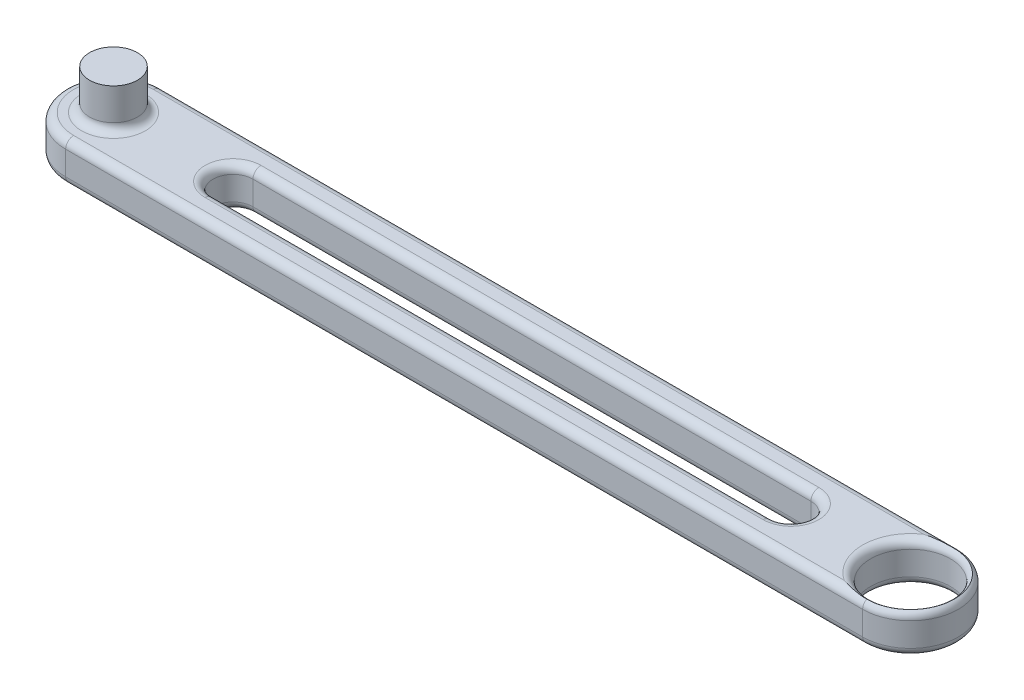
ISO-10303-21;
HEADER;
FILE_DESCRIPTION(('STEP AP214'),'2;1');
FILE_NAME('part.step','',(''),(''),'','','');
FILE_SCHEMA(('AUTOMOTIVE_DESIGN { 1 0 10303 214 1 1 1 1 }'));
ENDSEC;
DATA;
#1=APPLICATION_CONTEXT('core data for automotive mechanical design processes');
#2=APPLICATION_PROTOCOL_DEFINITION('international standard','automotive_design',2000,#1);
#3=PRODUCT_CONTEXT('',#1,'mechanical');
#4=PRODUCT('Part','Part','',(#3));
#5=PRODUCT_RELATED_PRODUCT_CATEGORY('part','',(#4));
#6=PRODUCT_DEFINITION_FORMATION('','',#4);
#7=PRODUCT_DEFINITION_CONTEXT('part definition',#1,'design');
#8=PRODUCT_DEFINITION('design','',#6,#7);
#9=PRODUCT_DEFINITION_SHAPE('','',#8);
#10=(LENGTH_UNIT() NAMED_UNIT(*) SI_UNIT(.MILLI.,.METRE.));
#11=(NAMED_UNIT(*) PLANE_ANGLE_UNIT() SI_UNIT($,.RADIAN.));
#12=(NAMED_UNIT(*) SI_UNIT($,.STERADIAN.) SOLID_ANGLE_UNIT());
#13=UNCERTAINTY_MEASURE_WITH_UNIT(LENGTH_MEASURE(1.E-05),#10,'distance_accuracy_value','');
#14=(GEOMETRIC_REPRESENTATION_CONTEXT(3) GLOBAL_UNCERTAINTY_ASSIGNED_CONTEXT((#13)) GLOBAL_UNIT_ASSIGNED_CONTEXT((#10,
#11,#12)) REPRESENTATION_CONTEXT('',''));
#15=CARTESIAN_POINT('',(0.,0.,0.));
#16=DIRECTION('',(0.,0.,1.));
#17=DIRECTION('',(1.,0.,0.));
#18=AXIS2_PLACEMENT_3D('',#15,#16,#17);
#19=CARTESIAN_POINT('',(-25.,0.,0.));
#20=DIRECTION('',(0.,1.,0.));
#21=DIRECTION('',(0.,0.,1.));
#22=AXIS2_PLACEMENT_3D('',#19,#20,#21);
#23=CYLINDRICAL_SURFACE('',#22,2.5);
#24=DIRECTION('',(0.,1.,0.));
#25=VECTOR('',#24,1.);
#26=CARTESIAN_POINT('',(-25.,0.,2.5));
#27=LINE('',#26,#25);
#28=CARTESIAN_POINT('',(-25.,1.,2.5));
#29=VERTEX_POINT('',#28);
#30=CARTESIAN_POINT('',(-25.,4.,2.5));
#31=VERTEX_POINT('',#30);
#32=EDGE_CURVE('E441',#29,#31,#27,.T.);
#33=ORIENTED_EDGE('',*,*,#32,.F.);
#34=CARTESIAN_POINT('',(-25.,1.,0.));
#35=DIRECTION('',(0.,1.,0.));
#36=DIRECTION('',(0.,0.,1.));
#37=AXIS2_PLACEMENT_3D('',#34,#35,#36);
#38=CIRCLE('',#37,2.5);
#39=CARTESIAN_POINT('',(-25.,1.,-2.5));
#40=VERTEX_POINT('',#39);
#41=EDGE_CURVE('E425',#29,#40,#38,.F.);
#42=ORIENTED_EDGE('',*,*,#41,.T.);
#43=DIRECTION('',(0.,1.,0.));
#44=VECTOR('',#43,1.);
#45=CARTESIAN_POINT('',(-25.,0.,-2.5));
#46=LINE('',#45,#44);
#47=CARTESIAN_POINT('',(-25.,4.,-2.5));
#48=VERTEX_POINT('',#47);
#49=EDGE_CURVE('E435',#40,#48,#46,.T.);
#50=ORIENTED_EDGE('',*,*,#49,.T.);
#51=CARTESIAN_POINT('',(-25.,4.,0.));
#52=DIRECTION('',(0.,1.,0.));
#53=DIRECTION('',(0.,0.,1.));
#54=AXIS2_PLACEMENT_3D('',#51,#52,#53);
#55=CIRCLE('',#54,2.5);
#56=EDGE_CURVE('E422',#48,#31,#55,.T.);
#57=ORIENTED_EDGE('',*,*,#56,.T.);
#58=EDGE_LOOP('',(#33,#42,#50,#57));
#59=FACE_BOUND('',#58,.T.);
#60=ADVANCED_FACE('F37',(#59),#23,.F.);
#61=CARTESIAN_POINT('',(-40.,5.,0.));
#62=DIRECTION('',(0.,-1.,0.));
#63=DIRECTION('',(0.,0.,-1.));
#64=AXIS2_PLACEMENT_3D('',#61,#62,#63);
#65=CYLINDRICAL_SURFACE('',#64,6.00000000000001);
#66=DIRECTION('',(0.,-1.,0.));
#67=VECTOR('',#66,1.);
#68=CARTESIAN_POINT('',(-40.,5.,-5.99999999999999));
#69=LINE('',#68,#67);
#70=CARTESIAN_POINT('',(-40.,4.,-5.99999999999999));
#71=VERTEX_POINT('',#70);
#72=CARTESIAN_POINT('',(-40.,1.,-5.99999999999999));
#73=VERTEX_POINT('',#72);
#74=EDGE_CURVE('E439',#71,#73,#69,.T.);
#75=ORIENTED_EDGE('',*,*,#74,.T.);
#76=CARTESIAN_POINT('',(-40.,1.,0.));
#77=DIRECTION('',(0.,1.,0.));
#78=DIRECTION('',(0.,0.,1.));
#79=AXIS2_PLACEMENT_3D('',#76,#77,#78);
#80=CIRCLE('',#79,6.00000000000001);
#81=CARTESIAN_POINT('',(-40.,1.,5.99999999999999));
#82=VERTEX_POINT('',#81);
#83=EDGE_CURVE('E369',#73,#82,#80,.T.);
#84=ORIENTED_EDGE('',*,*,#83,.T.);
#85=DIRECTION('',(0.,-1.,0.));
#86=VECTOR('',#85,1.);
#87=CARTESIAN_POINT('',(-40.,5.,5.99999999999999));
#88=LINE('',#87,#86);
#89=CARTESIAN_POINT('',(-40.,4.,5.99999999999999));
#90=VERTEX_POINT('',#89);
#91=EDGE_CURVE('E454',#90,#82,#88,.T.);
#92=ORIENTED_EDGE('',*,*,#91,.F.);
#93=CARTESIAN_POINT('',(-40.,4.,0.));
#94=DIRECTION('',(0.,1.,0.));
#95=DIRECTION('',(0.,0.,1.));
#96=AXIS2_PLACEMENT_3D('',#93,#94,#95);
#97=CIRCLE('',#96,6.00000000000001);
#98=EDGE_CURVE('E364',#90,#71,#97,.F.);
#99=ORIENTED_EDGE('',*,*,#98,.T.);
#100=EDGE_LOOP('',(#75,#84,#92,#99));
#101=FACE_BOUND('',#100,.T.);
#102=ADVANCED_FACE('F132',(#101),#65,.T.);
#103=CARTESIAN_POINT('',(-40.,5.,0.));
#104=DIRECTION('',(0.,1.,0.));
#105=DIRECTION('',(0.,0.,1.));
#106=AXIS2_PLACEMENT_3D('',#103,#104,#105);
#107=PLANE('',#106);
#108=DIRECTION('',(-1.,0.,0.));
#109=VECTOR('',#108,1.);
#110=CARTESIAN_POINT('',(-40.,5.,-4.99999999999999));
#111=LINE('',#110,#109);
#112=CARTESIAN_POINT('',(56.6833752096446,5.,-4.99999999999999));
#113=VERTEX_POINT('',#112);
#114=CARTESIAN_POINT('',(-40.,5.,-4.99999999999999));
#115=VERTEX_POINT('',#114);
#116=EDGE_CURVE('E47',#113,#115,#111,.T.);
#117=ORIENTED_EDGE('',*,*,#116,.T.);
#118=CARTESIAN_POINT('',(-40.,5.,0.));
#119=DIRECTION('',(0.,1.,0.));
#120=DIRECTION('',(0.,0.,1.));
#121=AXIS2_PLACEMENT_3D('',#118,#119,#120);
#122=CIRCLE('',#121,5.00000000000001);
#123=CARTESIAN_POINT('',(-40.,5.,4.99999999999999));
#124=VERTEX_POINT('',#123);
#125=EDGE_CURVE('E11',#115,#124,#122,.T.);
#126=ORIENTED_EDGE('',*,*,#125,.T.);
#127=DIRECTION('',(1.,0.,0.));
#128=VECTOR('',#127,1.);
#129=CARTESIAN_POINT('',(60.,5.,4.99999999999999));
#130=LINE('',#129,#128);
#131=CARTESIAN_POINT('',(56.6833752096446,5.,4.99999999999999));
#132=VERTEX_POINT('',#131);
#133=EDGE_CURVE('E290',#124,#132,#130,.T.);
#134=ORIENTED_EDGE('',*,*,#133,.T.);
#135=CARTESIAN_POINT('',(60.,5.,0.));
#136=DIRECTION('',(0.,1.,0.));
#137=DIRECTION('',(0.,0.,1.));
#138=AXIS2_PLACEMENT_3D('',#135,#136,#137);
#139=CIRCLE('',#138,6.);
#140=EDGE_CURVE('E288',#132,#113,#139,.F.);
#141=ORIENTED_EDGE('',*,*,#140,.T.);
#142=EDGE_LOOP('',(#117,#126,#134,#141));
#143=FACE_BOUND('',#142,.T.);
#144=DIRECTION('',(1.,0.,0.));
#145=VECTOR('',#144,1.);
#146=CARTESIAN_POINT('',(-25.,5.,3.5));
#147=LINE('',#146,#145);
#148=CARTESIAN_POINT('',(45.,5.,3.5));
#149=VERTEX_POINT('',#148);
#150=CARTESIAN_POINT('',(-25.,5.,3.5));
#151=VERTEX_POINT('',#150);
#152=EDGE_CURVE('E282',#149,#151,#147,.F.);
#153=ORIENTED_EDGE('',*,*,#152,.T.);
#154=CARTESIAN_POINT('',(-25.,5.,0.));
#155=DIRECTION('',(0.,1.,0.));
#156=DIRECTION('',(0.,0.,1.));
#157=AXIS2_PLACEMENT_3D('',#154,#155,#156);
#158=CIRCLE('',#157,3.5);
#159=CARTESIAN_POINT('',(-25.,5.,-3.5));
#160=VERTEX_POINT('',#159);
#161=EDGE_CURVE('E285',#151,#160,#158,.F.);
#162=ORIENTED_EDGE('',*,*,#161,.T.);
#163=DIRECTION('',(-1.,0.,0.));
#164=VECTOR('',#163,1.);
#165=CARTESIAN_POINT('',(45.,5.,-3.5));
#166=LINE('',#165,#164);
#167=CARTESIAN_POINT('',(45.,5.,-3.5));
#168=VERTEX_POINT('',#167);
#169=EDGE_CURVE('E270',#160,#168,#166,.F.);
#170=ORIENTED_EDGE('',*,*,#169,.T.);
#171=CARTESIAN_POINT('',(45.,5.,0.));
#172=DIRECTION('',(0.,1.,0.));
#173=DIRECTION('',(0.,0.,1.));
#174=AXIS2_PLACEMENT_3D('',#171,#172,#173);
#175=CIRCLE('',#174,3.5);
#176=EDGE_CURVE('E274',#168,#149,#175,.F.);
#177=ORIENTED_EDGE('',*,*,#176,.T.);
#178=EDGE_LOOP('',(#153,#162,#170,#177));
#179=FACE_BOUND('',#178,.T.);
#180=CARTESIAN_POINT('',(-40.,5.,0.));
#181=DIRECTION('',(0.,1.,0.));
#182=DIRECTION('',(0.,0.,1.));
#183=AXIS2_PLACEMENT_3D('',#180,#181,#182);
#184=CIRCLE('',#183,4.);
#185=CARTESIAN_POINT('',(-40.,5.,4.));
#186=VERTEX_POINT('',#185);
#187=EDGE_CURVE('E370',#186,#186,#184,.F.);
#188=ORIENTED_EDGE('',*,*,#187,.T.);
#189=EDGE_LOOP('',(#188));
#190=FACE_BOUND('',#189,.T.);
#191=ADVANCED_FACE('F138',(#143,#179,#190),#107,.T.);
#192=CARTESIAN_POINT('',(-40.,0.,0.));
#193=DIRECTION('',(0.,1.,0.));
#194=DIRECTION('',(0.,0.,1.));
#195=AXIS2_PLACEMENT_3D('',#192,#193,#194);
#196=PLANE('',#195);
#197=DIRECTION('',(1.,0.,0.));
#198=VECTOR('',#197,1.);
#199=CARTESIAN_POINT('',(-40.,0.,4.99999999999999));
#200=LINE('',#199,#198);
#201=CARTESIAN_POINT('',(56.6833752096446,0.,4.99999999999999));
#202=VERTEX_POINT('',#201);
#203=CARTESIAN_POINT('',(-40.,0.,4.99999999999999));
#204=VERTEX_POINT('',#203);
#205=EDGE_CURVE('E395',#202,#204,#200,.F.);
#206=ORIENTED_EDGE('',*,*,#205,.T.);
#207=CARTESIAN_POINT('',(-40.,0.,0.));
#208=DIRECTION('',(0.,1.,0.));
#209=DIRECTION('',(0.,0.,1.));
#210=AXIS2_PLACEMENT_3D('',#207,#208,#209);
#211=CIRCLE('',#210,5.00000000000001);
#212=CARTESIAN_POINT('',(-40.,0.,-4.99999999999999));
#213=VERTEX_POINT('',#212);
#214=EDGE_CURVE('E397',#204,#213,#211,.F.);
#215=ORIENTED_EDGE('',*,*,#214,.T.);
#216=DIRECTION('',(-1.,0.,0.));
#217=VECTOR('',#216,1.);
#218=CARTESIAN_POINT('',(-40.,0.,-4.99999999999999));
#219=LINE('',#218,#217);
#220=CARTESIAN_POINT('',(56.6833752096446,0.,-4.99999999999999));
#221=VERTEX_POINT('',#220);
#222=EDGE_CURVE('E392',#213,#221,#219,.F.);
#223=ORIENTED_EDGE('',*,*,#222,.T.);
#224=CARTESIAN_POINT('',(60.,0.,0.));
#225=DIRECTION('',(0.,1.,0.));
#226=DIRECTION('',(0.,0.,1.));
#227=AXIS2_PLACEMENT_3D('',#224,#225,#226);
#228=CIRCLE('',#227,6.);
#229=EDGE_CURVE('E389',#221,#202,#228,.T.);
#230=ORIENTED_EDGE('',*,*,#229,.T.);
#231=EDGE_LOOP('',(#206,#215,#223,#230));
#232=FACE_BOUND('',#231,.T.);
#233=CARTESIAN_POINT('',(-25.,0.,0.));
#234=DIRECTION('',(0.,1.,0.));
#235=DIRECTION('',(0.,0.,1.));
#236=AXIS2_PLACEMENT_3D('',#233,#234,#235);
#237=CIRCLE('',#236,3.5);
#238=CARTESIAN_POINT('',(-25.,0.,-3.5));
#239=VERTEX_POINT('',#238);
#240=CARTESIAN_POINT('',(-25.,0.,3.5));
#241=VERTEX_POINT('',#240);
#242=EDGE_CURVE('E383',#239,#241,#237,.T.);
#243=ORIENTED_EDGE('',*,*,#242,.T.);
#244=DIRECTION('',(1.,0.,0.));
#245=VECTOR('',#244,1.);
#246=CARTESIAN_POINT('',(-40.,0.,3.5));
#247=LINE('',#246,#245);
#248=CARTESIAN_POINT('',(45.,0.,3.5));
#249=VERTEX_POINT('',#248);
#250=EDGE_CURVE('E386',#241,#249,#247,.T.);
#251=ORIENTED_EDGE('',*,*,#250,.T.);
#252=CARTESIAN_POINT('',(45.,0.,0.));
#253=DIRECTION('',(0.,1.,0.));
#254=DIRECTION('',(0.,0.,1.));
#255=AXIS2_PLACEMENT_3D('',#252,#253,#254);
#256=CIRCLE('',#255,3.5);
#257=CARTESIAN_POINT('',(45.,0.,-3.5));
#258=VERTEX_POINT('',#257);
#259=EDGE_CURVE('E373',#249,#258,#256,.T.);
#260=ORIENTED_EDGE('',*,*,#259,.T.);
#261=DIRECTION('',(-1.,0.,0.));
#262=VECTOR('',#261,1.);
#263=CARTESIAN_POINT('',(-40.,0.,-3.5));
#264=LINE('',#263,#262);
#265=EDGE_CURVE('E254',#258,#239,#264,.T.);
#266=ORIENTED_EDGE('',*,*,#265,.T.);
#267=EDGE_LOOP('',(#243,#251,#260,#266));
#268=FACE_BOUND('',#267,.T.);
#269=ADVANCED_FACE('F165',(#232,#268),#196,.F.);
#270=CARTESIAN_POINT('',(60.,5.,5.99999999999999));
#271=DIRECTION('',(0.,0.,-1.));
#272=DIRECTION('',(-1.,0.,0.));
#273=AXIS2_PLACEMENT_3D('',#270,#271,#272);
#274=PLANE('',#273);
#275=ORIENTED_EDGE('',*,*,#91,.T.);
#276=DIRECTION('',(1.,0.,0.));
#277=VECTOR('',#276,1.);
#278=CARTESIAN_POINT('',(60.,1.,5.99999999999999));
#279=LINE('',#278,#277);
#280=CARTESIAN_POINT('',(60.,1.,5.99999999999999));
#281=VERTEX_POINT('',#280);
#282=EDGE_CURVE('E401',#82,#281,#279,.T.);
#283=ORIENTED_EDGE('',*,*,#282,.T.);
#284=DIRECTION('',(0.,-1.,0.));
#285=VECTOR('',#284,1.);
#286=CARTESIAN_POINT('',(60.,5.,5.99999999999999));
#287=LINE('',#286,#285);
#288=CARTESIAN_POINT('',(60.,4.,5.99999999999999));
#289=VERTEX_POINT('',#288);
#290=EDGE_CURVE('E452',#289,#281,#287,.T.);
#291=ORIENTED_EDGE('',*,*,#290,.F.);
#292=DIRECTION('',(1.,0.,0.));
#293=VECTOR('',#292,1.);
#294=CARTESIAN_POINT('',(-40.,4.,5.99999999999999));
#295=LINE('',#294,#293);
#296=EDGE_CURVE('E316',#289,#90,#295,.F.);
#297=ORIENTED_EDGE('',*,*,#296,.T.);
#298=EDGE_LOOP('',(#275,#283,#291,#297));
#299=FACE_BOUND('',#298,.T.);
#300=ADVANCED_FACE('F161',(#299),#274,.F.);
#301=CARTESIAN_POINT('',(-40.,5.,-5.99999999999999));
#302=DIRECTION('',(0.,0.,1.));
#303=DIRECTION('',(1.,0.,0.));
#304=AXIS2_PLACEMENT_3D('',#301,#302,#303);
#305=PLANE('',#304);
#306=DIRECTION('',(0.,-1.,0.));
#307=VECTOR('',#306,1.);
#308=CARTESIAN_POINT('',(60.,5.,-5.99999999999999));
#309=LINE('',#308,#307);
#310=CARTESIAN_POINT('',(60.,4.,-5.99999999999999));
#311=VERTEX_POINT('',#310);
#312=CARTESIAN_POINT('',(60.,1.,-5.99999999999999));
#313=VERTEX_POINT('',#312);
#314=EDGE_CURVE('E449',#311,#313,#309,.T.);
#315=ORIENTED_EDGE('',*,*,#314,.T.);
#316=DIRECTION('',(-1.,0.,0.));
#317=VECTOR('',#316,1.);
#318=CARTESIAN_POINT('',(-40.,1.,-5.99999999999999));
#319=LINE('',#318,#317);
#320=EDGE_CURVE('E408',#313,#73,#319,.T.);
#321=ORIENTED_EDGE('',*,*,#320,.T.);
#322=ORIENTED_EDGE('',*,*,#74,.F.);
#323=DIRECTION('',(-1.,0.,0.));
#324=VECTOR('',#323,1.);
#325=CARTESIAN_POINT('',(60.,4.,-5.99999999999999));
#326=LINE('',#325,#324);
#327=EDGE_CURVE('E406',#71,#311,#326,.F.);
#328=ORIENTED_EDGE('',*,*,#327,.T.);
#329=EDGE_LOOP('',(#315,#321,#322,#328));
#330=FACE_BOUND('',#329,.T.);
#331=ADVANCED_FACE('F157',(#330),#305,.F.);
#332=CARTESIAN_POINT('',(60.,5.,0.));
#333=DIRECTION('',(0.,-1.,0.));
#334=DIRECTION('',(0.,0.,-1.));
#335=AXIS2_PLACEMENT_3D('',#332,#333,#334);
#336=CYLINDRICAL_SURFACE('',#335,5.99999999999999);
#337=ORIENTED_EDGE('',*,*,#290,.T.);
#338=CARTESIAN_POINT('',(60.,1.,0.));
#339=DIRECTION('',(0.,1.,0.));
#340=DIRECTION('',(0.,0.,1.));
#341=AXIS2_PLACEMENT_3D('',#338,#339,#340);
#342=CIRCLE('',#341,5.99999999999999);
#343=EDGE_CURVE('E404',#281,#313,#342,.T.);
#344=ORIENTED_EDGE('',*,*,#343,.T.);
#345=ORIENTED_EDGE('',*,*,#314,.F.);
#346=CARTESIAN_POINT('',(60.,4.,0.));
#347=DIRECTION('',(0.,1.,0.));
#348=DIRECTION('',(0.,0.,1.));
#349=AXIS2_PLACEMENT_3D('',#346,#347,#348);
#350=CIRCLE('',#349,5.99999999999999);
#351=EDGE_CURVE('E92',#311,#289,#350,.F.);
#352=ORIENTED_EDGE('',*,*,#351,.T.);
#353=EDGE_LOOP('',(#337,#344,#345,#352));
#354=FACE_BOUND('',#353,.T.);
#355=ADVANCED_FACE('F153',(#354),#336,.T.);
#356=CARTESIAN_POINT('',(60.,0.,0.));
#357=DIRECTION('',(0.,1.,0.));
#358=DIRECTION('',(0.,0.,1.));
#359=AXIS2_PLACEMENT_3D('',#356,#357,#358);
#360=CYLINDRICAL_SURFACE('',#359,5.);
#361=CARTESIAN_POINT('',(60.,1.,0.));
#362=DIRECTION('',(0.,1.,0.));
#363=DIRECTION('',(0.,0.,1.));
#364=AXIS2_PLACEMENT_3D('',#361,#362,#363);
#365=CIRCLE('',#364,5.);
#366=CARTESIAN_POINT('',(60.,1.,5.));
#367=VERTEX_POINT('',#366);
#368=EDGE_CURVE('E414',#367,#367,#365,.F.);
#369=ORIENTED_EDGE('',*,*,#368,.T.);
#370=EDGE_LOOP('',(#369));
#371=FACE_BOUND('',#370,.T.);
#372=CARTESIAN_POINT('',(60.,4.,0.));
#373=DIRECTION('',(0.,1.,0.));
#374=DIRECTION('',(0.,0.,1.));
#375=AXIS2_PLACEMENT_3D('',#372,#373,#374);
#376=CIRCLE('',#375,5.);
#377=CARTESIAN_POINT('',(60.,4.,5.));
#378=VERTEX_POINT('',#377);
#379=EDGE_CURVE('E411',#378,#378,#376,.T.);
#380=ORIENTED_EDGE('',*,*,#379,.T.);
#381=EDGE_LOOP('',(#380));
#382=FACE_BOUND('',#381,.T.);
#383=ADVANCED_FACE('F149',(#371,#382),#360,.F.);
#384=CARTESIAN_POINT('',(45.,0.,0.));
#385=DIRECTION('',(0.,1.,0.));
#386=DIRECTION('',(0.,0.,1.));
#387=AXIS2_PLACEMENT_3D('',#384,#385,#386);
#388=CYLINDRICAL_SURFACE('',#387,2.5);
#389=DIRECTION('',(0.,1.,0.));
#390=VECTOR('',#389,1.);
#391=CARTESIAN_POINT('',(45.,0.,-2.5));
#392=LINE('',#391,#390);
#393=CARTESIAN_POINT('',(45.,1.,-2.5));
#394=VERTEX_POINT('',#393);
#395=CARTESIAN_POINT('',(45.,4.,-2.5));
#396=VERTEX_POINT('',#395);
#397=EDGE_CURVE('E432',#394,#396,#392,.T.);
#398=ORIENTED_EDGE('',*,*,#397,.F.);
#399=CARTESIAN_POINT('',(45.,1.,0.));
#400=DIRECTION('',(0.,1.,0.));
#401=DIRECTION('',(0.,0.,1.));
#402=AXIS2_PLACEMENT_3D('',#399,#400,#401);
#403=CIRCLE('',#402,2.5);
#404=CARTESIAN_POINT('',(45.,1.,2.5));
#405=VERTEX_POINT('',#404);
#406=EDGE_CURVE('E264',#394,#405,#403,.F.);
#407=ORIENTED_EDGE('',*,*,#406,.T.);
#408=DIRECTION('',(0.,1.,0.));
#409=VECTOR('',#408,1.);
#410=CARTESIAN_POINT('',(45.,0.,2.5));
#411=LINE('',#410,#409);
#412=CARTESIAN_POINT('',(45.,4.,2.5));
#413=VERTEX_POINT('',#412);
#414=EDGE_CURVE('E437',#405,#413,#411,.T.);
#415=ORIENTED_EDGE('',*,*,#414,.T.);
#416=CARTESIAN_POINT('',(45.,4.,0.));
#417=DIRECTION('',(0.,1.,0.));
#418=DIRECTION('',(0.,0.,1.));
#419=AXIS2_PLACEMENT_3D('',#416,#417,#418);
#420=CIRCLE('',#419,2.5);
#421=EDGE_CURVE('E271',#413,#396,#420,.T.);
#422=ORIENTED_EDGE('',*,*,#421,.T.);
#423=EDGE_LOOP('',(#398,#407,#415,#422));
#424=FACE_BOUND('',#423,.T.);
#425=ADVANCED_FACE('F146',(#424),#388,.F.);
#426=CARTESIAN_POINT('',(45.,0.,2.5));
#427=DIRECTION('',(0.,0.,1.));
#428=DIRECTION('',(1.,0.,0.));
#429=AXIS2_PLACEMENT_3D('',#426,#427,#428);
#430=PLANE('',#429);
#431=ORIENTED_EDGE('',*,*,#414,.F.);
#432=DIRECTION('',(1.,0.,0.));
#433=VECTOR('',#432,1.);
#434=CARTESIAN_POINT('',(45.,1.,2.5));
#435=LINE('',#434,#433);
#436=EDGE_CURVE('E419',#405,#29,#435,.F.);
#437=ORIENTED_EDGE('',*,*,#436,.T.);
#438=ORIENTED_EDGE('',*,*,#32,.T.);
#439=DIRECTION('',(1.,0.,0.));
#440=VECTOR('',#439,1.);
#441=CARTESIAN_POINT('',(45.,4.,2.5));
#442=LINE('',#441,#440);
#443=EDGE_CURVE('E417',#31,#413,#442,.T.);
#444=ORIENTED_EDGE('',*,*,#443,.T.);
#445=EDGE_LOOP('',(#431,#437,#438,#444));
#446=FACE_BOUND('',#445,.T.);
#447=ADVANCED_FACE('F144',(#446),#430,.F.);
#448=CARTESIAN_POINT('',(-25.,0.,-2.5));
#449=DIRECTION('',(0.,0.,-1.));
#450=DIRECTION('',(-1.,0.,0.));
#451=AXIS2_PLACEMENT_3D('',#448,#449,#450);
#452=PLANE('',#451);
#453=ORIENTED_EDGE('',*,*,#49,.F.);
#454=DIRECTION('',(-1.,0.,0.));
#455=VECTOR('',#454,1.);
#456=CARTESIAN_POINT('',(-25.,1.,-2.5));
#457=LINE('',#456,#455);
#458=EDGE_CURVE('E250',#40,#394,#457,.F.);
#459=ORIENTED_EDGE('',*,*,#458,.T.);
#460=ORIENTED_EDGE('',*,*,#397,.T.);
#461=DIRECTION('',(-1.,0.,0.));
#462=VECTOR('',#461,1.);
#463=CARTESIAN_POINT('',(-25.,4.,-2.5));
#464=LINE('',#463,#462);
#465=EDGE_CURVE('E427',#396,#48,#464,.T.);
#466=ORIENTED_EDGE('',*,*,#465,.T.);
#467=EDGE_LOOP('',(#453,#459,#460,#466));
#468=FACE_BOUND('',#467,.T.);
#469=ADVANCED_FACE('F431',(#468),#452,.F.);
#470=CARTESIAN_POINT('',(-40.,10.,0.));
#471=DIRECTION('',(0.,-1.,0.));
#472=DIRECTION('',(0.,0.,-1.));
#473=AXIS2_PLACEMENT_3D('',#470,#471,#472);
#474=CYLINDRICAL_SURFACE('',#473,3.);
#475=CARTESIAN_POINT('',(-40.,6.,0.));
#476=DIRECTION('',(0.,1.,0.));
#477=DIRECTION('',(0.,0.,1.));
#478=AXIS2_PLACEMENT_3D('',#475,#476,#477);
#479=CIRCLE('',#478,3.);
#480=CARTESIAN_POINT('',(-40.,6.,3.));
#481=VERTEX_POINT('',#480);
#482=EDGE_CURVE('E376',#481,#481,#479,.T.);
#483=ORIENTED_EDGE('',*,*,#482,.T.);
#484=EDGE_LOOP('',(#483));
#485=FACE_BOUND('',#484,.T.);
#486=CARTESIAN_POINT('',(-40.,10.,0.));
#487=DIRECTION('',(0.,1.,0.));
#488=DIRECTION('',(0.,0.,1.));
#489=AXIS2_PLACEMENT_3D('',#486,#487,#488);
#490=CIRCLE('',#489,3.);
#491=CARTESIAN_POINT('',(-40.,10.,3.));
#492=VERTEX_POINT('',#491);
#493=EDGE_CURVE('E447',#492,#492,#490,.T.);
#494=ORIENTED_EDGE('',*,*,#493,.F.);
#495=EDGE_LOOP('',(#494));
#496=FACE_BOUND('',#495,.T.);
#497=ADVANCED_FACE('F459',(#485,#496),#474,.T.);
#498=CARTESIAN_POINT('',(-40.,10.,0.));
#499=DIRECTION('',(0.,1.,0.));
#500=DIRECTION('',(0.,0.,1.));
#501=AXIS2_PLACEMENT_3D('',#498,#499,#500);
#502=PLANE('',#501);
#503=ORIENTED_EDGE('',*,*,#493,.T.);
#504=EDGE_LOOP('',(#503));
#505=FACE_BOUND('',#504,.T.);
#506=ADVANCED_FACE('F176',(#505),#502,.T.);
#507=CARTESIAN_POINT('',(-40.,6.,0.));
#508=DIRECTION('',(0.,1.,0.));
#509=DIRECTION('',(0.,0.,1.));
#510=AXIS2_PLACEMENT_3D('',#507,#508,#509);
#511=TOROIDAL_SURFACE('',#510,4.,1.);
#512=ORIENTED_EDGE('',*,*,#187,.F.);
#513=EDGE_LOOP('',(#512));
#514=FACE_BOUND('',#513,.T.);
#515=ORIENTED_EDGE('',*,*,#482,.F.);
#516=EDGE_LOOP('',(#515));
#517=FACE_BOUND('',#516,.T.);
#518=ADVANCED_FACE('F172',(#514,#517),#511,.F.);
#519=CARTESIAN_POINT('',(60.,1.,0.));
#520=DIRECTION('',(0.,1.,0.));
#521=DIRECTION('',(0.,0.,1.));
#522=AXIS2_PLACEMENT_3D('',#519,#520,#521);
#523=TOROIDAL_SURFACE('',#522,4.99999999999999,1.);
#524=CARTESIAN_POINT('',(60.,0.133974596215562,0.));
#525=DIRECTION('',(0.,1.,0.));
#526=DIRECTION('',(0.,0.,1.));
#527=AXIS2_PLACEMENT_3D('',#524,#525,#526);
#528=CIRCLE('',#527,5.5);
#529=CARTESIAN_POINT('',(60.,0.133974596215564,-5.5));
#530=VERTEX_POINT('',#529);
#531=CARTESIAN_POINT('',(60.,0.133974596215562,5.5));
#532=VERTEX_POINT('',#531);
#533=EDGE_CURVE('E214',#530,#532,#528,.F.);
#534=ORIENTED_EDGE('',*,*,#533,.F.);
#535=CARTESIAN_POINT('',(60.,1.,-4.99999999999999));
#536=DIRECTION('',(-1.,0.,0.));
#537=DIRECTION('',(0.,0.,1.));
#538=AXIS2_PLACEMENT_3D('',#535,#536,#537);
#539=CIRCLE('',#538,1.);
#540=EDGE_CURVE('E203',#313,#530,#539,.T.);
#541=ORIENTED_EDGE('',*,*,#540,.F.);
#542=ORIENTED_EDGE('',*,*,#343,.F.);
#543=CARTESIAN_POINT('',(60.,1.,4.99999999999999));
#544=DIRECTION('',(-1.,0.,0.));
#545=DIRECTION('',(0.,0.,1.));
#546=AXIS2_PLACEMENT_3D('',#543,#544,#545);
#547=CIRCLE('',#546,1.);
#548=EDGE_CURVE('E198',#532,#281,#547,.T.);
#549=ORIENTED_EDGE('',*,*,#548,.F.);
#550=EDGE_LOOP('',(#534,#541,#542,#549));
#551=FACE_BOUND('',#550,.T.);
#552=ADVANCED_FACE('F175',(#551),#523,.T.);
#553=CARTESIAN_POINT('',(60.,1.,0.));
#554=DIRECTION('',(0.,1.,0.));
#555=DIRECTION('',(0.,0.,1.));
#556=AXIS2_PLACEMENT_3D('',#553,#554,#555);
#557=TOROIDAL_SURFACE('',#556,6.,1.);
#558=ORIENTED_EDGE('',*,*,#368,.F.);
#559=EDGE_LOOP('',(#558));
#560=FACE_BOUND('',#559,.T.);
#561=CARTESIAN_POINT('',(56.6833752096446,0.,5.));
#562=CARTESIAN_POINT('',(56.6860900287263,5.75273852623949E-09,5.00081854980068));
#563=CARTESIAN_POINT('',(56.6888051323795,1.01058526795249E-06,5.0016361792849));
#564=CARTESIAN_POINT('',(56.8519266129809,0.000121021095467829,5.05069830612536));
#565=CARTESIAN_POINT('',(57.013322073721,0.00370391896033048,5.09572919812046));
#566=CARTESIAN_POINT('',(57.3377205260196,0.0152587427953715,5.17902717324149));
#567=CARTESIAN_POINT('',(57.5007241218305,0.0232323854597182,5.21729160307921));
#568=CARTESIAN_POINT('',(57.8282603309593,0.0413463743715818,5.28683598284365));
#569=CARTESIAN_POINT('',(57.9927942836252,0.0514888318138314,5.31810906605432));
#570=CARTESIAN_POINT('',(58.3230664570001,0.0718671923635551,5.37341634187307));
#571=CARTESIAN_POINT('',(58.4888046227378,0.0821030912109116,5.39745086281535));
#572=CARTESIAN_POINT('',(58.7665283020923,0.0977189152747434,5.43140816941913));
#573=CARTESIAN_POINT('',(58.8782396150488,0.103587860317217,5.44337160318336));
#574=CARTESIAN_POINT('',(59.1020297079682,0.114046344275322,5.46391676101722));
#575=CARTESIAN_POINT('',(59.2141084667476,0.1186359556777,5.47249867669428));
#576=CARTESIAN_POINT('',(59.4384437060584,0.126136064730062,5.4862373316829));
#577=CARTESIAN_POINT('',(59.5506999735175,0.129047898818249,5.49139679765319));
#578=CARTESIAN_POINT('',(59.7753693925576,0.13298256636052,5.49828087295584));
#579=CARTESIAN_POINT('',(59.887782567692,0.1340050765687,5.50000489451926));
#580=CARTESIAN_POINT('',(60.0002,0.133974595165834,5.49999999818181));
#581=B_SPLINE_CURVE_WITH_KNOTS('',3,(#561,#562,#563,#564,#565,#566,#567,#568,#569,#570,#571,
#572,#573,#574,#575,#576,#577,#578,#579,#580),.UNSPECIFIED.,.F.,.F.,(4,2,2,2,2,2,2,2,2,4),(0.,
0.00850662918467595,0.511018819969183,1.01372762270165,1.516928024466,2.02010559810748,
2.35756361689488,2.69500251150113,3.03217224530088,3.36939966039508),.UNSPECIFIED.);
#582=EDGE_CURVE('E190',#202,#532,#581,.T.);
#583=ORIENTED_EDGE('',*,*,#582,.F.);
#584=ORIENTED_EDGE('',*,*,#229,.F.);
#585=CARTESIAN_POINT('',(60.0002,0.133974595165834,-5.49999999818181));
#586=CARTESIAN_POINT('',(59.9163026544991,0.133984753882556,-5.50000242267181));
#587=CARTESIAN_POINT('',(59.8324064306582,0.13342240628381,-5.49904324367873));
#588=CARTESIAN_POINT('',(59.6646761453973,0.131220687152309,-5.49520844018713));
#589=CARTESIAN_POINT('',(59.5808420809659,0.129581371745773,-5.49233291555893));
#590=CARTESIAN_POINT('',(59.4133200699855,0.125294531726712,-5.48467368038643));
#591=CARTESIAN_POINT('',(59.3296320790875,0.122647401995233,-5.47989071717846));
#592=CARTESIAN_POINT('',(59.1624195317687,0.116475351963548,-5.46842954781569));
#593=CARTESIAN_POINT('',(59.0788949771311,0.112950422139023,-5.46175132109676));
#594=CARTESIAN_POINT('',(58.8286083941074,0.101296452937867,-5.43889440452494));
#595=CARTESIAN_POINT('',(58.6621469000799,0.092088626454218,-5.41989409729479));
#596=CARTESIAN_POINT('',(58.3303111228954,0.0724579595459584,-5.37453070399453));
#597=CARTESIAN_POINT('',(58.164936861542,0.0620350948327519,-5.34816747072495));
#598=CARTESIAN_POINT('',(57.889807585638,0.0452461108224515,-5.29814875242971));
#599=CARTESIAN_POINT('',(57.7797036566582,0.0386761140953831,-5.27646961798605));
#600=CARTESIAN_POINT('',(57.5601216605879,0.0265029474183351,-5.22995701696615));
#601=CARTESIAN_POINT('',(57.4506435792692,0.0208997554034836,-5.20512362240038));
#602=CARTESIAN_POINT('',(57.1233857079526,0.00652148047499684,-5.12602786581515));
#603=CARTESIAN_POINT('',(56.9065511192582,0.000160903310512655,-5.06712767258801));
#604=CARTESIAN_POINT('',(56.6888051282059,1.01444544203272E-06,-5.00163617899527));
#605=CARTESIAN_POINT('',(56.6860900245425,9.66704166583683E-09,-5.00081854950281));
#606=CARTESIAN_POINT('',(56.6833752096446,0.,-5.));
#607=B_SPLINE_CURVE_WITH_KNOTS('',3,(#585,#586,#587,#588,#589,#590,#591,#592,#593,#594,#595,
#596,#597,#598,#599,#600,#601,#602,#603,#604,#605,#606),.UNSPECIFIED.,.F.,.F.,(4,2,2,2,2,2,2,2,
2,2,4),(0.,0.251682738564798,0.503352361714136,0.754923477176686,1.00649732235826,
1.50968538897354,2.01288351603615,2.35006218016823,2.68723314803203,3.36086922842222,
3.36937585761171),.UNSPECIFIED.);
#608=EDGE_CURVE('E206',#530,#221,#607,.T.);
#609=ORIENTED_EDGE('',*,*,#608,.F.);
#610=ORIENTED_EDGE('',*,*,#533,.T.);
#611=EDGE_LOOP('',(#583,#584,#609,#610));
#612=FACE_BOUND('',#611,.T.);
#613=ADVANCED_FACE('F186',(#560,#612),#557,.T.);
#614=CARTESIAN_POINT('',(-40.,1.,-4.99999999999999));
#615=DIRECTION('',(-1.,0.,0.));
#616=DIRECTION('',(0.,0.,1.));
#617=AXIS2_PLACEMENT_3D('',#614,#615,#616);
#618=CYLINDRICAL_SURFACE('',#617,1.);
#619=ORIENTED_EDGE('',*,*,#608,.T.);
#620=ORIENTED_EDGE('',*,*,#222,.F.);
#621=CARTESIAN_POINT('',(-40.,1.,-4.99999999999999));
#622=DIRECTION('',(-1.,0.,0.));
#623=DIRECTION('',(0.,0.,1.));
#624=AXIS2_PLACEMENT_3D('',#621,#622,#623);
#625=CIRCLE('',#624,1.);
#626=EDGE_CURVE('E199',#73,#213,#625,.T.);
#627=ORIENTED_EDGE('',*,*,#626,.F.);
#628=ORIENTED_EDGE('',*,*,#320,.F.);
#629=ORIENTED_EDGE('',*,*,#540,.T.);
#630=EDGE_LOOP('',(#619,#620,#627,#628,#629));
#631=FACE_BOUND('',#630,.T.);
#632=ADVANCED_FACE('F218',(#631),#618,.T.);
#633=CARTESIAN_POINT('',(60.,1.,4.99999999999999));
#634=DIRECTION('',(1.,0.,0.));
#635=DIRECTION('',(0.,0.,-1.));
#636=AXIS2_PLACEMENT_3D('',#633,#634,#635);
#637=CYLINDRICAL_SURFACE('',#636,1.);
#638=ORIENTED_EDGE('',*,*,#548,.T.);
#639=ORIENTED_EDGE('',*,*,#282,.F.);
#640=CARTESIAN_POINT('',(-40.,1.,4.99999999999999));
#641=DIRECTION('',(-1.,0.,0.));
#642=DIRECTION('',(0.,0.,1.));
#643=AXIS2_PLACEMENT_3D('',#640,#641,#642);
#644=CIRCLE('',#643,1.);
#645=EDGE_CURVE('E293',#204,#82,#644,.T.);
#646=ORIENTED_EDGE('',*,*,#645,.F.);
#647=ORIENTED_EDGE('',*,*,#205,.F.);
#648=ORIENTED_EDGE('',*,*,#582,.T.);
#649=EDGE_LOOP('',(#638,#639,#646,#647,#648));
#650=FACE_BOUND('',#649,.T.);
#651=ADVANCED_FACE('F182',(#650),#637,.T.);
#652=CARTESIAN_POINT('',(-40.,1.,0.));
#653=DIRECTION('',(0.,1.,0.));
#654=DIRECTION('',(0.,0.,1.));
#655=AXIS2_PLACEMENT_3D('',#652,#653,#654);
#656=TOROIDAL_SURFACE('',#655,5.00000000000001,1.);
#657=ORIENTED_EDGE('',*,*,#626,.T.);
#658=ORIENTED_EDGE('',*,*,#214,.F.);
#659=ORIENTED_EDGE('',*,*,#645,.T.);
#660=ORIENTED_EDGE('',*,*,#83,.F.);
#661=EDGE_LOOP('',(#657,#658,#659,#660));
#662=FACE_BOUND('',#661,.T.);
#663=ADVANCED_FACE('F178',(#662),#656,.T.);
#664=CARTESIAN_POINT('',(-40.,1.,-3.5));
#665=DIRECTION('',(-1.,0.,0.));
#666=DIRECTION('',(0.,0.,1.));
#667=AXIS2_PLACEMENT_3D('',#664,#665,#666);
#668=CYLINDRICAL_SURFACE('',#667,1.);
#669=CARTESIAN_POINT('',(45.,1.,-3.5));
#670=DIRECTION('',(1.,0.,0.));
#671=DIRECTION('',(0.,0.,-1.));
#672=AXIS2_PLACEMENT_3D('',#669,#670,#671);
#673=CIRCLE('',#672,1.);
#674=EDGE_CURVE('E245',#394,#258,#673,.T.);
#675=ORIENTED_EDGE('',*,*,#674,.F.);
#676=ORIENTED_EDGE('',*,*,#458,.F.);
#677=CARTESIAN_POINT('',(-25.,1.,-3.5));
#678=DIRECTION('',(-1.,0.,0.));
#679=DIRECTION('',(0.,0.,1.));
#680=AXIS2_PLACEMENT_3D('',#677,#678,#679);
#681=CIRCLE('',#680,1.);
#682=EDGE_CURVE('E259',#239,#40,#681,.T.);
#683=ORIENTED_EDGE('',*,*,#682,.F.);
#684=ORIENTED_EDGE('',*,*,#265,.F.);
#685=EDGE_LOOP('',(#675,#676,#683,#684));
#686=FACE_BOUND('',#685,.T.);
#687=ADVANCED_FACE('F181',(#686),#668,.T.);
#688=CARTESIAN_POINT('',(-25.,1.,0.));
#689=DIRECTION('',(0.,1.,0.));
#690=DIRECTION('',(0.,0.,1.));
#691=AXIS2_PLACEMENT_3D('',#688,#689,#690);
#692=TOROIDAL_SURFACE('',#691,3.5,1.);
#693=ORIENTED_EDGE('',*,*,#682,.T.);
#694=ORIENTED_EDGE('',*,*,#41,.F.);
#695=CARTESIAN_POINT('',(-25.,1.,3.5));
#696=DIRECTION('',(1.,0.,0.));
#697=DIRECTION('',(0.,0.,-1.));
#698=AXIS2_PLACEMENT_3D('',#695,#696,#697);
#699=CIRCLE('',#698,1.);
#700=EDGE_CURVE('E260',#241,#29,#699,.T.);
#701=ORIENTED_EDGE('',*,*,#700,.F.);
#702=ORIENTED_EDGE('',*,*,#242,.F.);
#703=EDGE_LOOP('',(#693,#694,#701,#702));
#704=FACE_BOUND('',#703,.T.);
#705=ADVANCED_FACE('F231',(#704),#692,.T.);
#706=CARTESIAN_POINT('',(45.,1.,0.));
#707=DIRECTION('',(0.,1.,0.));
#708=DIRECTION('',(0.,0.,1.));
#709=AXIS2_PLACEMENT_3D('',#706,#707,#708);
#710=TOROIDAL_SURFACE('',#709,3.5,1.);
#711=ORIENTED_EDGE('',*,*,#674,.T.);
#712=ORIENTED_EDGE('',*,*,#259,.F.);
#713=CARTESIAN_POINT('',(45.,1.,3.5));
#714=DIRECTION('',(-1.,0.,0.));
#715=DIRECTION('',(0.,0.,1.));
#716=AXIS2_PLACEMENT_3D('',#713,#714,#715);
#717=CIRCLE('',#716,1.);
#718=EDGE_CURVE('E84',#405,#249,#717,.T.);
#719=ORIENTED_EDGE('',*,*,#718,.F.);
#720=ORIENTED_EDGE('',*,*,#406,.F.);
#721=EDGE_LOOP('',(#711,#712,#719,#720));
#722=FACE_BOUND('',#721,.T.);
#723=ADVANCED_FACE('F227',(#722),#710,.T.);
#724=CARTESIAN_POINT('',(-40.,1.,3.5));
#725=DIRECTION('',(1.,0.,0.));
#726=DIRECTION('',(0.,0.,-1.));
#727=AXIS2_PLACEMENT_3D('',#724,#725,#726);
#728=CYLINDRICAL_SURFACE('',#727,1.);
#729=ORIENTED_EDGE('',*,*,#700,.T.);
#730=ORIENTED_EDGE('',*,*,#436,.F.);
#731=ORIENTED_EDGE('',*,*,#718,.T.);
#732=ORIENTED_EDGE('',*,*,#250,.F.);
#733=EDGE_LOOP('',(#729,#730,#731,#732));
#734=FACE_BOUND('',#733,.T.);
#735=ADVANCED_FACE('F117',(#734),#728,.T.);
#736=CARTESIAN_POINT('',(60.,4.,0.));
#737=DIRECTION('',(0.,1.,0.));
#738=DIRECTION('',(0.,0.,1.));
#739=AXIS2_PLACEMENT_3D('',#736,#737,#738);
#740=TOROIDAL_SURFACE('',#739,6.,1.);
#741=ORIENTED_EDGE('',*,*,#379,.F.);
#742=EDGE_LOOP('',(#741));
#743=FACE_BOUND('',#742,.T.);
#744=CARTESIAN_POINT('',(60.,4.86602540378444,0.));
#745=DIRECTION('',(0.,-1.,0.));
#746=DIRECTION('',(0.,0.,-1.));
#747=AXIS2_PLACEMENT_3D('',#744,#745,#746);
#748=CIRCLE('',#747,5.5);
#749=CARTESIAN_POINT('',(60.,4.86602540378444,-5.5));
#750=VERTEX_POINT('',#749);
#751=CARTESIAN_POINT('',(60.,4.86602540378444,5.5));
#752=VERTEX_POINT('',#751);
#753=EDGE_CURVE('E73',#750,#752,#748,.T.);
#754=ORIENTED_EDGE('',*,*,#753,.F.);
#755=CARTESIAN_POINT('',(56.6833752096446,5.,-5.));
#756=CARTESIAN_POINT('',(56.6860900287263,4.99999999424726,-5.00081854980068));
#757=CARTESIAN_POINT('',(56.6888051323795,4.99999898941473,-5.0016361792849));
#758=CARTESIAN_POINT('',(56.8519266129809,4.99987897890454,-5.05069830612536));
#759=CARTESIAN_POINT('',(57.013322073721,4.99629608103967,-5.09572919812046));
#760=CARTESIAN_POINT('',(57.3377205260196,4.98474125720463,-5.1790271732415));
#761=CARTESIAN_POINT('',(57.5007241218305,4.97676761454028,-5.21729160307921));
#762=CARTESIAN_POINT('',(57.8282603309593,4.95865362562842,-5.28683598284365));
#763=CARTESIAN_POINT('',(57.9927942836252,4.94851116818617,-5.31810906605432));
#764=CARTESIAN_POINT('',(58.3230664570001,4.92813280763644,-5.37341634187307));
#765=CARTESIAN_POINT('',(58.4888046227378,4.91789690878909,-5.39745086281535));
#766=CARTESIAN_POINT('',(58.7665283020923,4.90228108472526,-5.43140816941913));
#767=CARTESIAN_POINT('',(58.8782396150488,4.89641213968278,-5.44337160318336));
#768=CARTESIAN_POINT('',(59.1020297079682,4.88595365572468,-5.46391676101722));
#769=CARTESIAN_POINT('',(59.2141084667476,4.8813640443223,-5.47249867669428));
#770=CARTESIAN_POINT('',(59.4384437060584,4.87386393526994,-5.4862373316829));
#771=CARTESIAN_POINT('',(59.5506999735175,4.87095210118175,-5.49139679765319));
#772=CARTESIAN_POINT('',(59.7753693925576,4.86701743363948,-5.49828087295584));
#773=CARTESIAN_POINT('',(59.887782567692,4.8659949234313,-5.50000489451926));
#774=CARTESIAN_POINT('',(60.0002,4.86602540483417,-5.49999999818181));
#775=B_SPLINE_CURVE_WITH_KNOTS('',3,(#755,#756,#757,#758,#759,#760,#761,#762,#763,#764,#765,
#766,#767,#768,#769,#770,#771,#772,#773,#774),.UNSPECIFIED.,.F.,.F.,(4,2,2,2,2,2,2,2,2,4),(0.,
0.00850662918467595,0.511018819969183,1.01372762270165,1.516928024466,2.02010559810748,
2.35756361689488,2.69500251150113,3.03217224530088,3.36939966039508),.UNSPECIFIED.);
#776=EDGE_CURVE('E80',#113,#750,#775,.T.);
#777=ORIENTED_EDGE('',*,*,#776,.F.);
#778=ORIENTED_EDGE('',*,*,#140,.F.);
#779=CARTESIAN_POINT('',(60.0002,4.86602540483417,5.49999999818181));
#780=CARTESIAN_POINT('',(59.9163026544991,4.86601524611744,5.50000242267181));
#781=CARTESIAN_POINT('',(59.8324064306582,4.86657759371619,5.49904324367873));
#782=CARTESIAN_POINT('',(59.6646761453973,4.86877931284769,5.49520844018713));
#783=CARTESIAN_POINT('',(59.5808420809659,4.87041862825423,5.49233291555893));
#784=CARTESIAN_POINT('',(59.4133200699855,4.87470546827329,5.48467368038643));
#785=CARTESIAN_POINT('',(59.3296320790876,4.87735259800477,5.47989071717846));
#786=CARTESIAN_POINT('',(59.1624195317687,4.88352464803645,5.46842954781569));
#787=CARTESIAN_POINT('',(59.0788949771311,4.88704957786098,5.46175132109676));
#788=CARTESIAN_POINT('',(58.8286083941074,4.89870354706213,5.43889440452495));
#789=CARTESIAN_POINT('',(58.6621469000799,4.90791137354578,5.41989409729479));
#790=CARTESIAN_POINT('',(58.3303111228954,4.92754204045404,5.37453070399453));
#791=CARTESIAN_POINT('',(58.164936861542,4.93796490516725,5.34816747072495));
#792=CARTESIAN_POINT('',(57.889807585638,4.95475388917755,5.29814875242971));
#793=CARTESIAN_POINT('',(57.7797036566582,4.96132388590462,5.27646961798605));
#794=CARTESIAN_POINT('',(57.5601216605879,4.97349705258167,5.22995701696615));
#795=CARTESIAN_POINT('',(57.4506435792692,4.97910024459652,5.20512362240038));
#796=CARTESIAN_POINT('',(57.1233857079526,4.993478519525,5.12602786581516));
#797=CARTESIAN_POINT('',(56.9065511192582,4.99983909668949,5.06712767258805));
#798=CARTESIAN_POINT('',(56.6888051282059,4.99999898555456,5.00163617899527));
#799=CARTESIAN_POINT('',(56.6860900245425,4.99999999033296,5.00081854950281));
#800=CARTESIAN_POINT('',(56.6833752096446,5.,5.));
#801=B_SPLINE_CURVE_WITH_KNOTS('',3,(#779,#780,#781,#782,#783,#784,#785,#786,#787,#788,#789,
#790,#791,#792,#793,#794,#795,#796,#797,#798,#799,#800),.UNSPECIFIED.,.F.,.F.,(4,2,2,2,2,2,2,2,
2,2,4),(0.,0.251682738564791,0.503352361714116,0.754923477176672,1.00649732235824,
1.50968538897354,2.01288351603615,2.35006218016823,2.68723314803203,3.36086922842222,
3.36937585761171),.UNSPECIFIED.);
#802=EDGE_CURVE('E82',#752,#132,#801,.T.);
#803=ORIENTED_EDGE('',*,*,#802,.F.);
#804=EDGE_LOOP('',(#754,#777,#778,#803));
#805=FACE_BOUND('',#804,.T.);
#806=ADVANCED_FACE('F77',(#743,#805),#740,.T.);
#807=CARTESIAN_POINT('',(60.,4.,0.));
#808=DIRECTION('',(0.,1.,0.));
#809=DIRECTION('',(0.,0.,1.));
#810=AXIS2_PLACEMENT_3D('',#807,#808,#809);
#811=TOROIDAL_SURFACE('',#810,4.99999999999999,1.);
#812=CARTESIAN_POINT('',(60.,4.,4.99999999999999));
#813=DIRECTION('',(-1.,0.,0.));
#814=DIRECTION('',(0.,0.,1.));
#815=AXIS2_PLACEMENT_3D('',#812,#813,#814);
#816=CIRCLE('',#815,1.);
#817=EDGE_CURVE('E98',#289,#752,#816,.T.);
#818=ORIENTED_EDGE('',*,*,#817,.F.);
#819=ORIENTED_EDGE('',*,*,#351,.F.);
#820=CARTESIAN_POINT('',(60.,4.,-4.99999999999999));
#821=DIRECTION('',(-1.,0.,0.));
#822=DIRECTION('',(0.,0.,1.));
#823=AXIS2_PLACEMENT_3D('',#820,#821,#822);
#824=CIRCLE('',#823,1.);
#825=EDGE_CURVE('E85',#750,#311,#824,.T.);
#826=ORIENTED_EDGE('',*,*,#825,.F.);
#827=ORIENTED_EDGE('',*,*,#753,.T.);
#828=EDGE_LOOP('',(#818,#819,#826,#827));
#829=FACE_BOUND('',#828,.T.);
#830=ADVANCED_FACE('F89',(#829),#811,.T.);
#831=CARTESIAN_POINT('',(-40.,4.,-4.99999999999999));
#832=DIRECTION('',(1.,0.,0.));
#833=DIRECTION('',(0.,0.,-1.));
#834=AXIS2_PLACEMENT_3D('',#831,#832,#833);
#835=CYLINDRICAL_SURFACE('',#834,1.);
#836=ORIENTED_EDGE('',*,*,#825,.T.);
#837=ORIENTED_EDGE('',*,*,#327,.F.);
#838=CARTESIAN_POINT('',(-40.,4.,-4.99999999999999));
#839=DIRECTION('',(-1.,0.,0.));
#840=DIRECTION('',(0.,0.,1.));
#841=AXIS2_PLACEMENT_3D('',#838,#839,#840);
#842=CIRCLE('',#841,1.);
#843=EDGE_CURVE('E308',#115,#71,#842,.T.);
#844=ORIENTED_EDGE('',*,*,#843,.F.);
#845=ORIENTED_EDGE('',*,*,#116,.F.);
#846=ORIENTED_EDGE('',*,*,#776,.T.);
#847=EDGE_LOOP('',(#836,#837,#844,#845,#846));
#848=FACE_BOUND('',#847,.T.);
#849=ADVANCED_FACE('F96',(#848),#835,.T.);
#850=CARTESIAN_POINT('',(-40.,4.,4.99999999999999));
#851=DIRECTION('',(-1.,0.,0.));
#852=DIRECTION('',(0.,0.,1.));
#853=AXIS2_PLACEMENT_3D('',#850,#851,#852);
#854=CYLINDRICAL_SURFACE('',#853,1.);
#855=ORIENTED_EDGE('',*,*,#802,.T.);
#856=ORIENTED_EDGE('',*,*,#133,.F.);
#857=CARTESIAN_POINT('',(-40.,4.,4.99999999999999));
#858=DIRECTION('',(-1.,0.,0.));
#859=DIRECTION('',(0.,0.,1.));
#860=AXIS2_PLACEMENT_3D('',#857,#858,#859);
#861=CIRCLE('',#860,1.);
#862=EDGE_CURVE('E306',#90,#124,#861,.T.);
#863=ORIENTED_EDGE('',*,*,#862,.F.);
#864=ORIENTED_EDGE('',*,*,#296,.F.);
#865=ORIENTED_EDGE('',*,*,#817,.T.);
#866=EDGE_LOOP('',(#855,#856,#863,#864,#865));
#867=FACE_BOUND('',#866,.T.);
#868=ADVANCED_FACE('F121',(#867),#854,.T.);
#869=CARTESIAN_POINT('',(-40.,4.,0.));
#870=DIRECTION('',(0.,1.,0.));
#871=DIRECTION('',(0.,0.,1.));
#872=AXIS2_PLACEMENT_3D('',#869,#870,#871);
#873=TOROIDAL_SURFACE('',#872,5.00000000000001,1.);
#874=ORIENTED_EDGE('',*,*,#843,.T.);
#875=ORIENTED_EDGE('',*,*,#98,.F.);
#876=ORIENTED_EDGE('',*,*,#862,.T.);
#877=ORIENTED_EDGE('',*,*,#125,.F.);
#878=EDGE_LOOP('',(#874,#875,#876,#877));
#879=FACE_BOUND('',#878,.T.);
#880=ADVANCED_FACE('F124',(#879),#873,.T.);
#881=CARTESIAN_POINT('',(45.,4.,0.));
#882=DIRECTION('',(0.,1.,0.));
#883=DIRECTION('',(0.,0.,1.));
#884=AXIS2_PLACEMENT_3D('',#881,#882,#883);
#885=TOROIDAL_SURFACE('',#884,3.5,1.);
#886=CARTESIAN_POINT('',(45.,4.,3.5));
#887=DIRECTION('',(-1.,0.,0.));
#888=DIRECTION('',(0.,0.,1.));
#889=AXIS2_PLACEMENT_3D('',#886,#887,#888);
#890=CIRCLE('',#889,1.);
#891=EDGE_CURVE('E515',#149,#413,#890,.T.);
#892=ORIENTED_EDGE('',*,*,#891,.F.);
#893=ORIENTED_EDGE('',*,*,#176,.F.);
#894=CARTESIAN_POINT('',(45.,4.,-3.5));
#895=DIRECTION('',(-1.,0.,0.));
#896=DIRECTION('',(0.,0.,1.));
#897=AXIS2_PLACEMENT_3D('',#894,#895,#896);
#898=CIRCLE('',#897,1.);
#899=EDGE_CURVE('E41',#396,#168,#898,.T.);
#900=ORIENTED_EDGE('',*,*,#899,.F.);
#901=ORIENTED_EDGE('',*,*,#421,.F.);
#902=EDGE_LOOP('',(#892,#893,#900,#901));
#903=FACE_BOUND('',#902,.T.);
#904=ADVANCED_FACE('F39',(#903),#885,.T.);
#905=CARTESIAN_POINT('',(-25.,4.,-3.5));
#906=DIRECTION('',(1.,0.,0.));
#907=DIRECTION('',(0.,0.,-1.));
#908=AXIS2_PLACEMENT_3D('',#905,#906,#907);
#909=CYLINDRICAL_SURFACE('',#908,1.);
#910=ORIENTED_EDGE('',*,*,#899,.T.);
#911=ORIENTED_EDGE('',*,*,#169,.F.);
#912=CARTESIAN_POINT('',(-25.,4.,-3.5));
#913=DIRECTION('',(-1.,0.,0.));
#914=DIRECTION('',(0.,0.,1.));
#915=AXIS2_PLACEMENT_3D('',#912,#913,#914);
#916=CIRCLE('',#915,1.);
#917=EDGE_CURVE('E504',#48,#160,#916,.T.);
#918=ORIENTED_EDGE('',*,*,#917,.F.);
#919=ORIENTED_EDGE('',*,*,#465,.F.);
#920=EDGE_LOOP('',(#910,#911,#918,#919));
#921=FACE_BOUND('',#920,.T.);
#922=ADVANCED_FACE('F521',(#921),#909,.T.);
#923=CARTESIAN_POINT('',(45.,4.,3.5));
#924=DIRECTION('',(-1.,0.,0.));
#925=DIRECTION('',(0.,0.,1.));
#926=AXIS2_PLACEMENT_3D('',#923,#924,#925);
#927=CYLINDRICAL_SURFACE('',#926,1.);
#928=ORIENTED_EDGE('',*,*,#891,.T.);
#929=ORIENTED_EDGE('',*,*,#443,.F.);
#930=CARTESIAN_POINT('',(-25.,4.,3.5));
#931=DIRECTION('',(-1.,0.,0.));
#932=DIRECTION('',(0.,0.,1.));
#933=AXIS2_PLACEMENT_3D('',#930,#931,#932);
#934=CIRCLE('',#933,1.);
#935=EDGE_CURVE('E507',#151,#31,#934,.T.);
#936=ORIENTED_EDGE('',*,*,#935,.F.);
#937=ORIENTED_EDGE('',*,*,#152,.F.);
#938=EDGE_LOOP('',(#928,#929,#936,#937));
#939=FACE_BOUND('',#938,.T.);
#940=ADVANCED_FACE('F513',(#939),#927,.T.);
#941=CARTESIAN_POINT('',(-25.,4.,0.));
#942=DIRECTION('',(0.,1.,0.));
#943=DIRECTION('',(0.,0.,1.));
#944=AXIS2_PLACEMENT_3D('',#941,#942,#943);
#945=TOROIDAL_SURFACE('',#944,3.5,1.);
#946=ORIENTED_EDGE('',*,*,#917,.T.);
#947=ORIENTED_EDGE('',*,*,#161,.F.);
#948=ORIENTED_EDGE('',*,*,#935,.T.);
#949=ORIENTED_EDGE('',*,*,#56,.F.);
#950=EDGE_LOOP('',(#946,#947,#948,#949));
#951=FACE_BOUND('',#950,.T.);
#952=ADVANCED_FACE('F502',(#951),#945,.T.);
#953=CLOSED_SHELL('',(#60,#102,#191,#269,#300,#331,#355,#383,#425,#447,#469,#497,#506,#518,#552,
#613,#632,#651,#663,#687,#705,#723,#735,#806,#830,#849,#868,#880,#904,#922,#940,#952));
#954=MANIFOLD_SOLID_BREP('B2',#953);
#955=ADVANCED_BREP_SHAPE_REPRESENTATION('',(#18,#954),#14);
#956=SHAPE_DEFINITION_REPRESENTATION(#9,#955);
ENDSEC;
END-ISO-10303-21;
